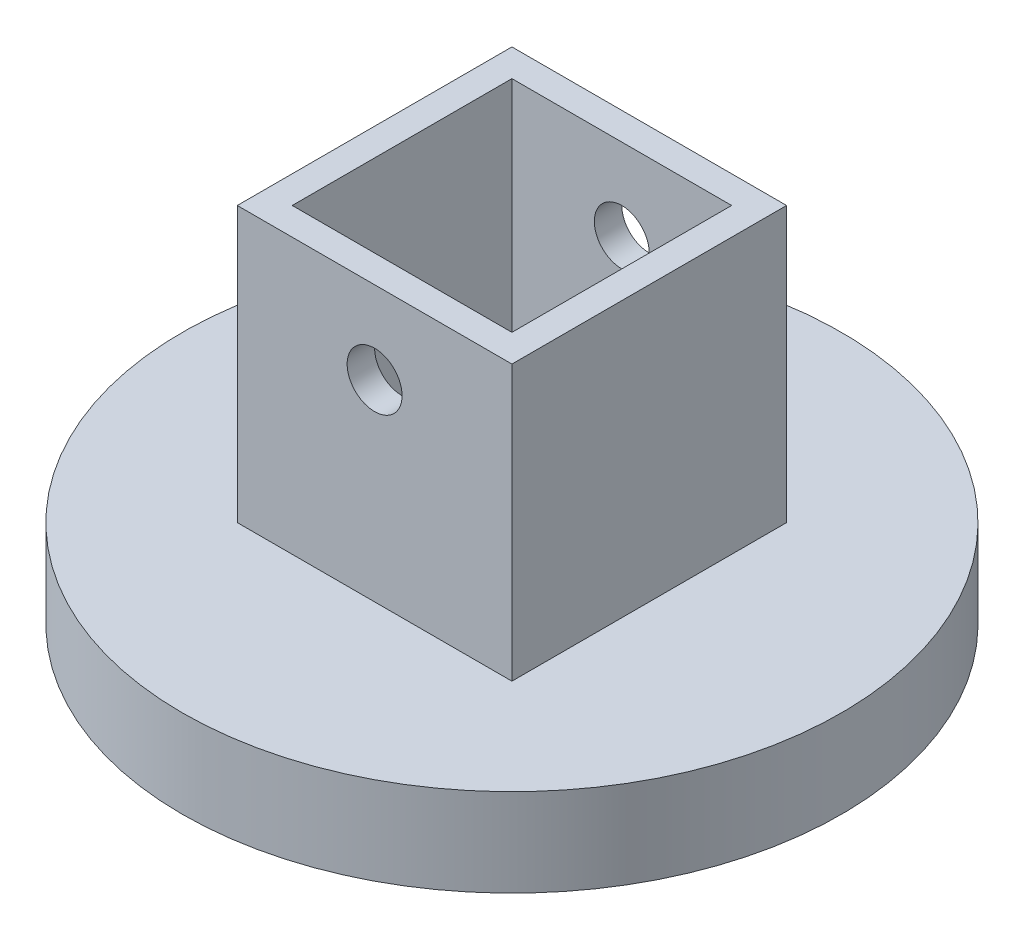
ISO-10303-21;
HEADER;
FILE_DESCRIPTION(('STEP AP214'),'2;1');
FILE_NAME('part.step','',(''),(''),'','','');
FILE_SCHEMA(('AUTOMOTIVE_DESIGN { 1 0 10303 214 1 1 1 1 }'));
ENDSEC;
DATA;
#1=APPLICATION_CONTEXT('core data for automotive mechanical design processes');
#2=APPLICATION_PROTOCOL_DEFINITION('international standard','automotive_design',2000,#1);
#3=PRODUCT_CONTEXT('',#1,'mechanical');
#4=PRODUCT('Part','Part','',(#3));
#5=PRODUCT_RELATED_PRODUCT_CATEGORY('part','',(#4));
#6=PRODUCT_DEFINITION_FORMATION('','',#4);
#7=PRODUCT_DEFINITION_CONTEXT('part definition',#1,'design');
#8=PRODUCT_DEFINITION('design','',#6,#7);
#9=PRODUCT_DEFINITION_SHAPE('','',#8);
#10=(LENGTH_UNIT() NAMED_UNIT(*) SI_UNIT(.MILLI.,.METRE.));
#11=(NAMED_UNIT(*) PLANE_ANGLE_UNIT() SI_UNIT($,.RADIAN.));
#12=(NAMED_UNIT(*) SI_UNIT($,.STERADIAN.) SOLID_ANGLE_UNIT());
#13=UNCERTAINTY_MEASURE_WITH_UNIT(LENGTH_MEASURE(1.E-05),#10,'distance_accuracy_value','');
#14=(GEOMETRIC_REPRESENTATION_CONTEXT(3) GLOBAL_UNCERTAINTY_ASSIGNED_CONTEXT((#13)) GLOBAL_UNIT_ASSIGNED_CONTEXT((#10,
#11,#12)) REPRESENTATION_CONTEXT('',''));
#15=CARTESIAN_POINT('',(0.,0.,0.));
#16=DIRECTION('',(0.,0.,1.));
#17=DIRECTION('',(1.,0.,0.));
#18=AXIS2_PLACEMENT_3D('',#15,#16,#17);
#19=CARTESIAN_POINT('',(0.,10.16,0.));
#20=DIRECTION('',(0.,-1.,0.));
#21=DIRECTION('',(0.,0.,-1.));
#22=AXIS2_PLACEMENT_3D('',#19,#20,#21);
#23=CYLINDRICAL_SURFACE('',#22,38.1);
#24=CARTESIAN_POINT('',(0.,10.16,0.));
#25=DIRECTION('',(0.,1.,0.));
#26=DIRECTION('',(0.,0.,1.));
#27=AXIS2_PLACEMENT_3D('',#24,#25,#26);
#28=CIRCLE('',#27,38.1);
#29=CARTESIAN_POINT('',(0.,10.16,38.1));
#30=VERTEX_POINT('',#29);
#31=EDGE_CURVE('E11',#30,#30,#28,.T.);
#32=ORIENTED_EDGE('',*,*,#31,.F.);
#33=EDGE_LOOP('',(#32));
#34=FACE_BOUND('',#33,.T.);
#35=CARTESIAN_POINT('',(0.,0.,0.));
#36=DIRECTION('',(0.,1.,0.));
#37=DIRECTION('',(0.,0.,1.));
#38=AXIS2_PLACEMENT_3D('',#35,#36,#37);
#39=CIRCLE('',#38,38.1);
#40=CARTESIAN_POINT('',(0.,0.,38.1));
#41=VERTEX_POINT('',#40);
#42=EDGE_CURVE('E45',#41,#41,#39,.T.);
#43=ORIENTED_EDGE('',*,*,#42,.T.);
#44=EDGE_LOOP('',(#43));
#45=FACE_BOUND('',#44,.T.);
#46=ADVANCED_FACE('F37',(#34,#45),#23,.T.);
#47=CARTESIAN_POINT('',(0.,10.16,0.));
#48=DIRECTION('',(0.,1.,0.));
#49=DIRECTION('',(0.,0.,1.));
#50=AXIS2_PLACEMENT_3D('',#47,#48,#49);
#51=PLANE('',#50);
#52=DIRECTION('',(0.,0.,1.));
#53=VECTOR('',#52,1.);
#54=CARTESIAN_POINT('',(-15.875,10.16,15.875));
#55=LINE('',#54,#53);
#56=CARTESIAN_POINT('',(-15.875,10.16,-15.875));
#57=VERTEX_POINT('',#56);
#58=CARTESIAN_POINT('',(-15.875,10.16,15.875));
#59=VERTEX_POINT('',#58);
#60=EDGE_CURVE('E139',#57,#59,#55,.T.);
#61=ORIENTED_EDGE('',*,*,#60,.F.);
#62=DIRECTION('',(-1.,0.,0.));
#63=VECTOR('',#62,1.);
#64=CARTESIAN_POINT('',(15.875,10.16,-15.875));
#65=LINE('',#64,#63);
#66=CARTESIAN_POINT('',(15.875,10.16,-15.875));
#67=VERTEX_POINT('',#66);
#68=EDGE_CURVE('E147',#67,#57,#65,.T.);
#69=ORIENTED_EDGE('',*,*,#68,.F.);
#70=DIRECTION('',(0.,0.,-1.));
#71=VECTOR('',#70,1.);
#72=CARTESIAN_POINT('',(15.875,10.16,15.875));
#73=LINE('',#72,#71);
#74=CARTESIAN_POINT('',(15.875,10.16,15.875));
#75=VERTEX_POINT('',#74);
#76=EDGE_CURVE('E159',#75,#67,#73,.T.);
#77=ORIENTED_EDGE('',*,*,#76,.F.);
#78=DIRECTION('',(1.,0.,0.));
#79=VECTOR('',#78,1.);
#80=CARTESIAN_POINT('',(15.875,10.16,15.875));
#81=LINE('',#80,#79);
#82=EDGE_CURVE('E156',#59,#75,#81,.T.);
#83=ORIENTED_EDGE('',*,*,#82,.F.);
#84=EDGE_LOOP('',(#61,#69,#77,#83));
#85=FACE_BOUND('',#84,.T.);
#86=ORIENTED_EDGE('',*,*,#31,.T.);
#87=EDGE_LOOP('',(#86));
#88=FACE_BOUND('',#87,.T.);
#89=ADVANCED_FACE('F179',(#85,#88),#51,.T.);
#90=CARTESIAN_POINT('',(0.,0.,0.));
#91=DIRECTION('',(0.,1.,0.));
#92=DIRECTION('',(0.,0.,1.));
#93=AXIS2_PLACEMENT_3D('',#90,#91,#92);
#94=PLANE('',#93);
#95=DIRECTION('',(1.,0.,0.));
#96=VECTOR('',#95,1.);
#97=CARTESIAN_POINT('',(-12.7,0.,12.7));
#98=LINE('',#97,#96);
#99=CARTESIAN_POINT('',(-12.7,0.,12.7));
#100=VERTEX_POINT('',#99);
#101=CARTESIAN_POINT('',(12.7,0.,12.7));
#102=VERTEX_POINT('',#101);
#103=EDGE_CURVE('E111',#100,#102,#98,.T.);
#104=ORIENTED_EDGE('',*,*,#103,.T.);
#105=DIRECTION('',(0.,0.,-1.));
#106=VECTOR('',#105,1.);
#107=CARTESIAN_POINT('',(12.7,0.,-12.7));
#108=LINE('',#107,#106);
#109=CARTESIAN_POINT('',(12.7,0.,-12.7));
#110=VERTEX_POINT('',#109);
#111=EDGE_CURVE('E105',#102,#110,#108,.T.);
#112=ORIENTED_EDGE('',*,*,#111,.T.);
#113=DIRECTION('',(-1.,0.,0.));
#114=VECTOR('',#113,1.);
#115=CARTESIAN_POINT('',(-12.7,0.,-12.7));
#116=LINE('',#115,#114);
#117=CARTESIAN_POINT('',(-12.7,0.,-12.7));
#118=VERTEX_POINT('',#117);
#119=EDGE_CURVE('E114',#110,#118,#116,.T.);
#120=ORIENTED_EDGE('',*,*,#119,.T.);
#121=DIRECTION('',(0.,0.,1.));
#122=VECTOR('',#121,1.);
#123=CARTESIAN_POINT('',(-12.7,0.,-12.7));
#124=LINE('',#123,#122);
#125=EDGE_CURVE('E53',#118,#100,#124,.T.);
#126=ORIENTED_EDGE('',*,*,#125,.T.);
#127=EDGE_LOOP('',(#104,#112,#120,#126));
#128=FACE_BOUND('',#127,.T.);
#129=ORIENTED_EDGE('',*,*,#42,.F.);
#130=EDGE_LOOP('',(#129));
#131=FACE_BOUND('',#130,.T.);
#132=ADVANCED_FACE('F118',(#128,#131),#94,.F.);
#133=CARTESIAN_POINT('',(-15.875,41.91,15.875));
#134=DIRECTION('',(1.,0.,0.));
#135=DIRECTION('',(0.,0.,-1.));
#136=AXIS2_PLACEMENT_3D('',#133,#134,#135);
#137=PLANE('',#136);
#138=ORIENTED_EDGE('',*,*,#60,.T.);
#139=DIRECTION('',(0.,-1.,0.));
#140=VECTOR('',#139,1.);
#141=CARTESIAN_POINT('',(-15.875,41.91,15.875));
#142=LINE('',#141,#140);
#143=CARTESIAN_POINT('',(-15.875,41.91,15.875));
#144=VERTEX_POINT('',#143);
#145=EDGE_CURVE('E172',#144,#59,#142,.T.);
#146=ORIENTED_EDGE('',*,*,#145,.F.);
#147=DIRECTION('',(0.,0.,1.));
#148=VECTOR('',#147,1.);
#149=CARTESIAN_POINT('',(-15.875,41.91,15.875));
#150=LINE('',#149,#148);
#151=CARTESIAN_POINT('',(-15.875,41.91,-15.875));
#152=VERTEX_POINT('',#151);
#153=EDGE_CURVE('E143',#152,#144,#150,.T.);
#154=ORIENTED_EDGE('',*,*,#153,.F.);
#155=DIRECTION('',(0.,-1.,0.));
#156=VECTOR('',#155,1.);
#157=CARTESIAN_POINT('',(-15.875,41.91,-15.875));
#158=LINE('',#157,#156);
#159=EDGE_CURVE('E153',#152,#57,#158,.T.);
#160=ORIENTED_EDGE('',*,*,#159,.T.);
#161=EDGE_LOOP('',(#138,#146,#154,#160));
#162=FACE_BOUND('',#161,.T.);
#163=ADVANCED_FACE('F178',(#162),#137,.F.);
#164=CARTESIAN_POINT('',(15.875,41.91,15.875));
#165=DIRECTION('',(0.,0.,-1.));
#166=DIRECTION('',(-1.,0.,0.));
#167=AXIS2_PLACEMENT_3D('',#164,#165,#166);
#168=PLANE('',#167);
#169=CARTESIAN_POINT('',(0.,32.385,15.875));
#170=DIRECTION('',(0.,0.,1.));
#171=DIRECTION('',(1.,0.,0.));
#172=AXIS2_PLACEMENT_3D('',#169,#170,#171);
#173=CIRCLE('',#172,3.175);
#174=CARTESIAN_POINT('',(3.175,32.385,15.875));
#175=VERTEX_POINT('',#174);
#176=EDGE_CURVE('E310',#175,#175,#173,.T.);
#177=ORIENTED_EDGE('',*,*,#176,.F.);
#178=EDGE_LOOP('',(#177));
#179=FACE_BOUND('',#178,.T.);
#180=ORIENTED_EDGE('',*,*,#82,.T.);
#181=DIRECTION('',(0.,-1.,0.));
#182=VECTOR('',#181,1.);
#183=CARTESIAN_POINT('',(15.875,41.91,15.875));
#184=LINE('',#183,#182);
#185=CARTESIAN_POINT('',(15.875,41.91,15.875));
#186=VERTEX_POINT('',#185);
#187=EDGE_CURVE('E169',#186,#75,#184,.T.);
#188=ORIENTED_EDGE('',*,*,#187,.F.);
#189=DIRECTION('',(1.,0.,0.));
#190=VECTOR('',#189,1.);
#191=CARTESIAN_POINT('',(15.875,41.91,15.875));
#192=LINE('',#191,#190);
#193=EDGE_CURVE('E146',#144,#186,#192,.T.);
#194=ORIENTED_EDGE('',*,*,#193,.F.);
#195=ORIENTED_EDGE('',*,*,#145,.T.);
#196=EDGE_LOOP('',(#180,#188,#194,#195));
#197=FACE_BOUND('',#196,.T.);
#198=ADVANCED_FACE('F184',(#179,#197),#168,.F.);
#199=CARTESIAN_POINT('',(15.875,41.91,15.875));
#200=DIRECTION('',(-1.,0.,0.));
#201=DIRECTION('',(0.,0.,1.));
#202=AXIS2_PLACEMENT_3D('',#199,#200,#201);
#203=PLANE('',#202);
#204=ORIENTED_EDGE('',*,*,#76,.T.);
#205=DIRECTION('',(0.,-1.,0.));
#206=VECTOR('',#205,1.);
#207=CARTESIAN_POINT('',(15.875,41.91,-15.875));
#208=LINE('',#207,#206);
#209=CARTESIAN_POINT('',(15.875,41.91,-15.875));
#210=VERTEX_POINT('',#209);
#211=EDGE_CURVE('E166',#210,#67,#208,.T.);
#212=ORIENTED_EDGE('',*,*,#211,.F.);
#213=DIRECTION('',(0.,0.,-1.));
#214=VECTOR('',#213,1.);
#215=CARTESIAN_POINT('',(15.875,41.91,15.875));
#216=LINE('',#215,#214);
#217=EDGE_CURVE('E149',#186,#210,#216,.T.);
#218=ORIENTED_EDGE('',*,*,#217,.F.);
#219=ORIENTED_EDGE('',*,*,#187,.T.);
#220=EDGE_LOOP('',(#204,#212,#218,#219));
#221=FACE_BOUND('',#220,.T.);
#222=ADVANCED_FACE('F213',(#221),#203,.F.);
#223=CARTESIAN_POINT('',(15.875,41.91,-15.875));
#224=DIRECTION('',(0.,0.,1.));
#225=DIRECTION('',(1.,0.,0.));
#226=AXIS2_PLACEMENT_3D('',#223,#224,#225);
#227=PLANE('',#226);
#228=CARTESIAN_POINT('',(0.,32.385,-15.875));
#229=DIRECTION('',(0.,0.,1.));
#230=DIRECTION('',(1.,0.,0.));
#231=AXIS2_PLACEMENT_3D('',#228,#229,#230);
#232=CIRCLE('',#231,3.175);
#233=CARTESIAN_POINT('',(3.175,32.385,-15.875));
#234=VERTEX_POINT('',#233);
#235=EDGE_CURVE('E127',#234,#234,#232,.T.);
#236=ORIENTED_EDGE('',*,*,#235,.T.);
#237=EDGE_LOOP('',(#236));
#238=FACE_BOUND('',#237,.T.);
#239=ORIENTED_EDGE('',*,*,#68,.T.);
#240=ORIENTED_EDGE('',*,*,#159,.F.);
#241=DIRECTION('',(-1.,0.,0.));
#242=VECTOR('',#241,1.);
#243=CARTESIAN_POINT('',(15.875,41.91,-15.875));
#244=LINE('',#243,#242);
#245=EDGE_CURVE('E151',#210,#152,#244,.T.);
#246=ORIENTED_EDGE('',*,*,#245,.F.);
#247=ORIENTED_EDGE('',*,*,#211,.T.);
#248=EDGE_LOOP('',(#239,#240,#246,#247));
#249=FACE_BOUND('',#248,.T.);
#250=ADVANCED_FACE('F217',(#238,#249),#227,.F.);
#251=CARTESIAN_POINT('',(0.,41.91,0.));
#252=DIRECTION('',(0.,1.,0.));
#253=DIRECTION('',(0.,0.,1.));
#254=AXIS2_PLACEMENT_3D('',#251,#252,#253);
#255=PLANE('',#254);
#256=DIRECTION('',(0.,0.,-1.));
#257=VECTOR('',#256,1.);
#258=CARTESIAN_POINT('',(12.7,41.91,-12.7));
#259=LINE('',#258,#257);
#260=CARTESIAN_POINT('',(12.7,41.91,12.7));
#261=VERTEX_POINT('',#260);
#262=CARTESIAN_POINT('',(12.7,41.91,-12.7));
#263=VERTEX_POINT('',#262);
#264=EDGE_CURVE('E61',#261,#263,#259,.T.);
#265=ORIENTED_EDGE('',*,*,#264,.F.);
#266=DIRECTION('',(1.,0.,0.));
#267=VECTOR('',#266,1.);
#268=CARTESIAN_POINT('',(-12.7,41.91,12.7));
#269=LINE('',#268,#267);
#270=CARTESIAN_POINT('',(-12.7,41.91,12.7));
#271=VERTEX_POINT('',#270);
#272=EDGE_CURVE('E121',#271,#261,#269,.T.);
#273=ORIENTED_EDGE('',*,*,#272,.F.);
#274=DIRECTION('',(0.,0.,1.));
#275=VECTOR('',#274,1.);
#276=CARTESIAN_POINT('',(-12.7,41.91,-12.7));
#277=LINE('',#276,#275);
#278=CARTESIAN_POINT('',(-12.7,41.91,-12.7));
#279=VERTEX_POINT('',#278);
#280=EDGE_CURVE('E124',#279,#271,#277,.T.);
#281=ORIENTED_EDGE('',*,*,#280,.F.);
#282=DIRECTION('',(-1.,0.,0.));
#283=VECTOR('',#282,1.);
#284=CARTESIAN_POINT('',(-12.7,41.91,-12.7));
#285=LINE('',#284,#283);
#286=EDGE_CURVE('E133',#263,#279,#285,.T.);
#287=ORIENTED_EDGE('',*,*,#286,.F.);
#288=EDGE_LOOP('',(#265,#273,#281,#287));
#289=FACE_BOUND('',#288,.T.);
#290=ORIENTED_EDGE('',*,*,#153,.T.);
#291=ORIENTED_EDGE('',*,*,#193,.T.);
#292=ORIENTED_EDGE('',*,*,#217,.T.);
#293=ORIENTED_EDGE('',*,*,#245,.T.);
#294=EDGE_LOOP('',(#290,#291,#292,#293));
#295=FACE_BOUND('',#294,.T.);
#296=ADVANCED_FACE('F229',(#289,#295),#255,.T.);
#297=CARTESIAN_POINT('',(12.7,0.,-12.7));
#298=DIRECTION('',(1.,0.,0.));
#299=DIRECTION('',(0.,0.,-1.));
#300=AXIS2_PLACEMENT_3D('',#297,#298,#299);
#301=PLANE('',#300);
#302=ORIENTED_EDGE('',*,*,#264,.T.);
#303=DIRECTION('',(0.,1.,0.));
#304=VECTOR('',#303,1.);
#305=CARTESIAN_POINT('',(12.7,0.,-12.7));
#306=LINE('',#305,#304);
#307=EDGE_CURVE('E101',#110,#263,#306,.T.);
#308=ORIENTED_EDGE('',*,*,#307,.F.);
#309=ORIENTED_EDGE('',*,*,#111,.F.);
#310=DIRECTION('',(0.,1.,0.));
#311=VECTOR('',#310,1.);
#312=CARTESIAN_POINT('',(12.7,0.,12.7));
#313=LINE('',#312,#311);
#314=EDGE_CURVE('E137',#102,#261,#313,.T.);
#315=ORIENTED_EDGE('',*,*,#314,.T.);
#316=EDGE_LOOP('',(#302,#308,#309,#315));
#317=FACE_BOUND('',#316,.T.);
#318=ADVANCED_FACE('F103',(#317),#301,.F.);
#319=CARTESIAN_POINT('',(-12.7,0.,12.7));
#320=DIRECTION('',(0.,0.,1.));
#321=DIRECTION('',(1.,0.,0.));
#322=AXIS2_PLACEMENT_3D('',#319,#320,#321);
#323=PLANE('',#322);
#324=CARTESIAN_POINT('',(0.,32.385,12.7));
#325=DIRECTION('',(0.,0.,1.));
#326=DIRECTION('',(1.,0.,0.));
#327=AXIS2_PLACEMENT_3D('',#324,#325,#326);
#328=CIRCLE('',#327,3.175);
#329=CARTESIAN_POINT('',(3.175,32.385,12.7));
#330=VERTEX_POINT('',#329);
#331=EDGE_CURVE('E313',#330,#330,#328,.T.);
#332=ORIENTED_EDGE('',*,*,#331,.T.);
#333=EDGE_LOOP('',(#332));
#334=FACE_BOUND('',#333,.T.);
#335=ORIENTED_EDGE('',*,*,#272,.T.);
#336=ORIENTED_EDGE('',*,*,#314,.F.);
#337=ORIENTED_EDGE('',*,*,#103,.F.);
#338=DIRECTION('',(0.,1.,0.));
#339=VECTOR('',#338,1.);
#340=CARTESIAN_POINT('',(-12.7,0.,12.7));
#341=LINE('',#340,#339);
#342=EDGE_CURVE('E140',#100,#271,#341,.T.);
#343=ORIENTED_EDGE('',*,*,#342,.T.);
#344=EDGE_LOOP('',(#335,#336,#337,#343));
#345=FACE_BOUND('',#344,.T.);
#346=ADVANCED_FACE('F243',(#334,#345),#323,.F.);
#347=CARTESIAN_POINT('',(-12.7,0.,-12.7));
#348=DIRECTION('',(-1.,0.,0.));
#349=DIRECTION('',(0.,0.,1.));
#350=AXIS2_PLACEMENT_3D('',#347,#348,#349);
#351=PLANE('',#350);
#352=ORIENTED_EDGE('',*,*,#280,.T.);
#353=ORIENTED_EDGE('',*,*,#342,.F.);
#354=ORIENTED_EDGE('',*,*,#125,.F.);
#355=DIRECTION('',(0.,1.,0.));
#356=VECTOR('',#355,1.);
#357=CARTESIAN_POINT('',(-12.7,0.,-12.7));
#358=LINE('',#357,#356);
#359=EDGE_CURVE('E110',#118,#279,#358,.T.);
#360=ORIENTED_EDGE('',*,*,#359,.T.);
#361=EDGE_LOOP('',(#352,#353,#354,#360));
#362=FACE_BOUND('',#361,.T.);
#363=ADVANCED_FACE('F250',(#362),#351,.F.);
#364=CARTESIAN_POINT('',(-12.7,0.,-12.7));
#365=DIRECTION('',(0.,0.,-1.));
#366=DIRECTION('',(-1.,0.,0.));
#367=AXIS2_PLACEMENT_3D('',#364,#365,#366);
#368=PLANE('',#367);
#369=CARTESIAN_POINT('',(0.,32.385,-12.7));
#370=DIRECTION('',(0.,0.,-1.));
#371=DIRECTION('',(-1.,0.,0.));
#372=AXIS2_PLACEMENT_3D('',#369,#370,#371);
#373=CIRCLE('',#372,3.175);
#374=CARTESIAN_POINT('',(-3.175,32.385,-12.7));
#375=VERTEX_POINT('',#374);
#376=EDGE_CURVE('E40',#375,#375,#373,.T.);
#377=ORIENTED_EDGE('',*,*,#376,.T.);
#378=EDGE_LOOP('',(#377));
#379=FACE_BOUND('',#378,.T.);
#380=ORIENTED_EDGE('',*,*,#286,.T.);
#381=ORIENTED_EDGE('',*,*,#359,.F.);
#382=ORIENTED_EDGE('',*,*,#119,.F.);
#383=ORIENTED_EDGE('',*,*,#307,.T.);
#384=EDGE_LOOP('',(#380,#381,#382,#383));
#385=FACE_BOUND('',#384,.T.);
#386=ADVANCED_FACE('F115',(#379,#385),#368,.F.);
#387=CARTESIAN_POINT('',(0.,32.385,-38.1));
#388=DIRECTION('',(0.,0.,1.));
#389=DIRECTION('',(1.,0.,0.));
#390=AXIS2_PLACEMENT_3D('',#387,#388,#389);
#391=CYLINDRICAL_SURFACE('',#390,3.175);
#392=ORIENTED_EDGE('',*,*,#376,.F.);
#393=EDGE_LOOP('',(#392));
#394=FACE_BOUND('',#393,.T.);
#395=ORIENTED_EDGE('',*,*,#235,.F.);
#396=EDGE_LOOP('',(#395));
#397=FACE_BOUND('',#396,.T.);
#398=ADVANCED_FACE('F284',(#394,#397),#391,.F.);
#399=ORIENTED_EDGE('',*,*,#176,.T.);
#400=EDGE_LOOP('',(#399));
#401=FACE_BOUND('',#400,.T.);
#402=ORIENTED_EDGE('',*,*,#331,.F.);
#403=EDGE_LOOP('',(#402));
#404=FACE_BOUND('',#403,.T.);
#405=ADVANCED_FACE('F294',(#401,#404),#391,.F.);
#406=CLOSED_SHELL('',(#46,#89,#132,#163,#198,#222,#250,#296,#318,#346,#363,#386,#398,#405));
#407=MANIFOLD_SOLID_BREP('B2',#406);
#408=ADVANCED_BREP_SHAPE_REPRESENTATION('',(#18,#407),#14);
#409=SHAPE_DEFINITION_REPRESENTATION(#9,#408);
ENDSEC;
END-ISO-10303-21;
